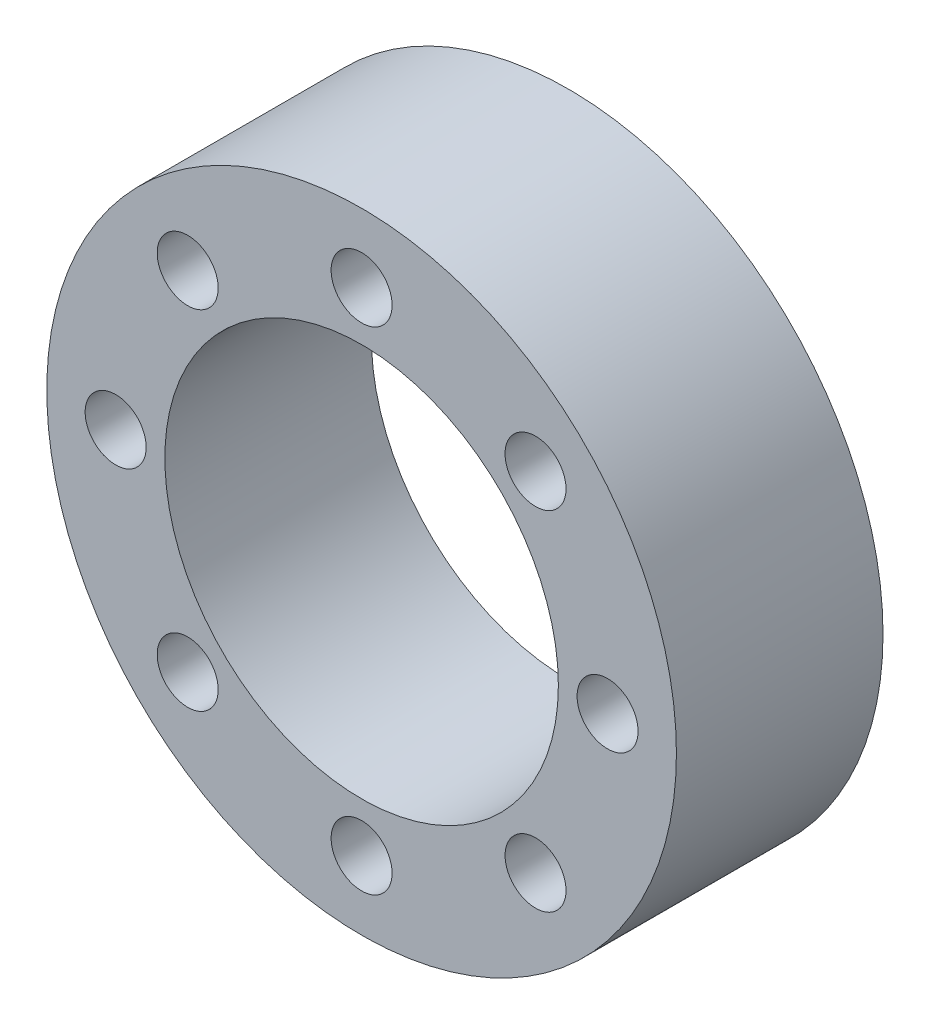
ISO-10303-21;
HEADER;
FILE_DESCRIPTION(('STEP AP214'),'2;1');
FILE_NAME('part.step','',(''),(''),'','','');
FILE_SCHEMA(('AUTOMOTIVE_DESIGN { 1 0 10303 214 1 1 1 1 }'));
ENDSEC;
DATA;
#1=APPLICATION_CONTEXT('core data for automotive mechanical design processes');
#2=APPLICATION_PROTOCOL_DEFINITION('international standard','automotive_design',2000,#1);
#3=PRODUCT_CONTEXT('',#1,'mechanical');
#4=PRODUCT('Part','Part','',(#3));
#5=PRODUCT_RELATED_PRODUCT_CATEGORY('part','',(#4));
#6=PRODUCT_DEFINITION_FORMATION('','',#4);
#7=PRODUCT_DEFINITION_CONTEXT('part definition',#1,'design');
#8=PRODUCT_DEFINITION('design','',#6,#7);
#9=PRODUCT_DEFINITION_SHAPE('','',#8);
#10=(LENGTH_UNIT() NAMED_UNIT(*) SI_UNIT(.MILLI.,.METRE.));
#11=(NAMED_UNIT(*) PLANE_ANGLE_UNIT() SI_UNIT($,.RADIAN.));
#12=(NAMED_UNIT(*) SI_UNIT($,.STERADIAN.) SOLID_ANGLE_UNIT());
#13=UNCERTAINTY_MEASURE_WITH_UNIT(LENGTH_MEASURE(1.E-05),#10,'distance_accuracy_value','');
#14=(GEOMETRIC_REPRESENTATION_CONTEXT(3) GLOBAL_UNCERTAINTY_ASSIGNED_CONTEXT((#13)) GLOBAL_UNIT_ASSIGNED_CONTEXT((#10,
#11,#12)) REPRESENTATION_CONTEXT('',''));
#15=CARTESIAN_POINT('',(0.,0.,0.));
#16=DIRECTION('',(0.,0.,1.));
#17=DIRECTION('',(1.,0.,0.));
#18=AXIS2_PLACEMENT_3D('',#15,#16,#17);
#19=CARTESIAN_POINT('',(0.,0.,10.5));
#20=DIRECTION('',(0.,0.,1.));
#21=DIRECTION('',(1.,0.,0.));
#22=AXIS2_PLACEMENT_3D('',#19,#20,#21);
#23=PLANE('',#22);
#24=CARTESIAN_POINT('',(-8.83883476483185,8.83883476483184,10.5));
#25=DIRECTION('',(0.,0.,1.));
#26=DIRECTION('',(1.,0.,0.));
#27=AXIS2_PLACEMENT_3D('',#24,#25,#26);
#28=CIRCLE('',#27,1.55);
#29=CARTESIAN_POINT('',(-7.28883476483185,8.83883476483184,10.5));
#30=VERTEX_POINT('',#29);
#31=EDGE_CURVE('E84',#30,#30,#28,.T.);
#32=ORIENTED_EDGE('',*,*,#31,.F.);
#33=EDGE_LOOP('',(#32));
#34=FACE_BOUND('',#33,.T.);
#35=CARTESIAN_POINT('',(-8.83883476483184,-8.83883476483185,10.5));
#36=DIRECTION('',(0.,0.,1.));
#37=DIRECTION('',(1.,0.,0.));
#38=AXIS2_PLACEMENT_3D('',#35,#36,#37);
#39=CIRCLE('',#38,1.55);
#40=CARTESIAN_POINT('',(-7.28883476483184,-8.83883476483185,10.5));
#41=VERTEX_POINT('',#40);
#42=EDGE_CURVE('E72',#41,#41,#39,.T.);
#43=ORIENTED_EDGE('',*,*,#42,.F.);
#44=EDGE_LOOP('',(#43));
#45=FACE_BOUND('',#44,.T.);
#46=CARTESIAN_POINT('',(8.83883476483185,-8.83883476483184,10.5));
#47=DIRECTION('',(0.,0.,1.));
#48=DIRECTION('',(1.,0.,0.));
#49=AXIS2_PLACEMENT_3D('',#46,#47,#48);
#50=CIRCLE('',#49,1.55);
#51=CARTESIAN_POINT('',(10.3888347648318,-8.83883476483184,10.5));
#52=VERTEX_POINT('',#51);
#53=EDGE_CURVE('E60',#52,#52,#50,.T.);
#54=ORIENTED_EDGE('',*,*,#53,.F.);
#55=EDGE_LOOP('',(#54));
#56=FACE_BOUND('',#55,.T.);
#57=CARTESIAN_POINT('',(8.83883476483184,8.83883476483185,10.5));
#58=DIRECTION('',(0.,0.,1.));
#59=DIRECTION('',(1.,0.,0.));
#60=AXIS2_PLACEMENT_3D('',#57,#58,#59);
#61=CIRCLE('',#60,1.55);
#62=CARTESIAN_POINT('',(10.3888347648318,8.83883476483185,10.5));
#63=VERTEX_POINT('',#62);
#64=EDGE_CURVE('E48',#63,#63,#61,.T.);
#65=ORIENTED_EDGE('',*,*,#64,.F.);
#66=EDGE_LOOP('',(#65));
#67=FACE_BOUND('',#66,.T.);
#68=CARTESIAN_POINT('',(0.,0.,10.5));
#69=DIRECTION('',(0.,0.,1.));
#70=DIRECTION('',(1.,0.,0.));
#71=AXIS2_PLACEMENT_3D('',#68,#69,#70);
#72=CIRCLE('',#71,16.);
#73=CARTESIAN_POINT('',(16.,0.,10.5));
#74=VERTEX_POINT('',#73);
#75=EDGE_CURVE('E10',#74,#74,#72,.T.);
#76=ORIENTED_EDGE('',*,*,#75,.T.);
#77=EDGE_LOOP('',(#76));
#78=FACE_BOUND('',#77,.T.);
#79=CARTESIAN_POINT('',(0.,12.5,10.5));
#80=DIRECTION('',(0.,0.,1.));
#81=DIRECTION('',(1.,0.,0.));
#82=AXIS2_PLACEMENT_3D('',#79,#80,#81);
#83=CIRCLE('',#82,1.55);
#84=CARTESIAN_POINT('',(1.55,12.5,10.5));
#85=VERTEX_POINT('',#84);
#86=EDGE_CURVE('E43',#85,#85,#83,.T.);
#87=ORIENTED_EDGE('',*,*,#86,.F.);
#88=EDGE_LOOP('',(#87));
#89=FACE_BOUND('',#88,.T.);
#90=CARTESIAN_POINT('',(12.5,0.,10.5));
#91=DIRECTION('',(0.,0.,1.));
#92=DIRECTION('',(1.,0.,0.));
#93=AXIS2_PLACEMENT_3D('',#90,#91,#92);
#94=CIRCLE('',#93,1.55);
#95=CARTESIAN_POINT('',(14.05,0.,10.5));
#96=VERTEX_POINT('',#95);
#97=EDGE_CURVE('E54',#96,#96,#94,.T.);
#98=ORIENTED_EDGE('',*,*,#97,.F.);
#99=EDGE_LOOP('',(#98));
#100=FACE_BOUND('',#99,.T.);
#101=CARTESIAN_POINT('',(0.,-12.5,10.5));
#102=DIRECTION('',(0.,0.,1.));
#103=DIRECTION('',(1.,0.,0.));
#104=AXIS2_PLACEMENT_3D('',#101,#102,#103);
#105=CIRCLE('',#104,1.55);
#106=CARTESIAN_POINT('',(1.55,-12.5,10.5));
#107=VERTEX_POINT('',#106);
#108=EDGE_CURVE('E66',#107,#107,#105,.T.);
#109=ORIENTED_EDGE('',*,*,#108,.F.);
#110=EDGE_LOOP('',(#109));
#111=FACE_BOUND('',#110,.T.);
#112=CARTESIAN_POINT('',(-12.5,0.,10.5));
#113=DIRECTION('',(0.,0.,1.));
#114=DIRECTION('',(1.,0.,0.));
#115=AXIS2_PLACEMENT_3D('',#112,#113,#114);
#116=CIRCLE('',#115,1.55);
#117=CARTESIAN_POINT('',(-10.95,0.,10.5));
#118=VERTEX_POINT('',#117);
#119=EDGE_CURVE('E78',#118,#118,#116,.T.);
#120=ORIENTED_EDGE('',*,*,#119,.F.);
#121=EDGE_LOOP('',(#120));
#122=FACE_BOUND('',#121,.T.);
#123=CARTESIAN_POINT('',(0.,0.,10.5));
#124=DIRECTION('',(0.,0.,1.));
#125=DIRECTION('',(1.,0.,0.));
#126=AXIS2_PLACEMENT_3D('',#123,#124,#125);
#127=CIRCLE('',#126,10.);
#128=CARTESIAN_POINT('',(10.,0.,10.5));
#129=VERTEX_POINT('',#128);
#130=EDGE_CURVE('E90',#129,#129,#127,.T.);
#131=ORIENTED_EDGE('',*,*,#130,.F.);
#132=EDGE_LOOP('',(#131));
#133=FACE_BOUND('',#132,.T.);
#134=ADVANCED_FACE('F32',(#34,#45,#56,#67,#78,#89,#100,#111,#122,#133),#23,.T.);
#135=CARTESIAN_POINT('',(0.,0.,0.));
#136=DIRECTION('',(0.,0.,1.));
#137=DIRECTION('',(1.,0.,0.));
#138=AXIS2_PLACEMENT_3D('',#135,#136,#137);
#139=PLANE('',#138);
#140=CARTESIAN_POINT('',(0.,0.,0.));
#141=DIRECTION('',(0.,0.,1.));
#142=DIRECTION('',(1.,0.,0.));
#143=AXIS2_PLACEMENT_3D('',#140,#141,#142);
#144=CIRCLE('',#143,16.);
#145=CARTESIAN_POINT('',(16.,0.,0.));
#146=VERTEX_POINT('',#145);
#147=EDGE_CURVE('E36',#146,#146,#144,.T.);
#148=ORIENTED_EDGE('',*,*,#147,.F.);
#149=EDGE_LOOP('',(#148));
#150=FACE_BOUND('',#149,.T.);
#151=CARTESIAN_POINT('',(0.,12.5,0.));
#152=DIRECTION('',(0.,0.,1.));
#153=DIRECTION('',(1.,0.,0.));
#154=AXIS2_PLACEMENT_3D('',#151,#152,#153);
#155=CIRCLE('',#154,1.55);
#156=CARTESIAN_POINT('',(1.55,12.5,0.));
#157=VERTEX_POINT('',#156);
#158=EDGE_CURVE('E45',#157,#157,#155,.T.);
#159=ORIENTED_EDGE('',*,*,#158,.T.);
#160=EDGE_LOOP('',(#159));
#161=FACE_BOUND('',#160,.T.);
#162=CARTESIAN_POINT('',(8.83883476483184,8.83883476483185,0.));
#163=DIRECTION('',(0.,0.,1.));
#164=DIRECTION('',(1.,0.,0.));
#165=AXIS2_PLACEMENT_3D('',#162,#163,#164);
#166=CIRCLE('',#165,1.55);
#167=CARTESIAN_POINT('',(10.3888347648318,8.83883476483185,0.));
#168=VERTEX_POINT('',#167);
#169=EDGE_CURVE('E51',#168,#168,#166,.T.);
#170=ORIENTED_EDGE('',*,*,#169,.T.);
#171=EDGE_LOOP('',(#170));
#172=FACE_BOUND('',#171,.T.);
#173=CARTESIAN_POINT('',(12.5,0.,0.));
#174=DIRECTION('',(0.,0.,1.));
#175=DIRECTION('',(1.,0.,0.));
#176=AXIS2_PLACEMENT_3D('',#173,#174,#175);
#177=CIRCLE('',#176,1.55);
#178=CARTESIAN_POINT('',(14.05,0.,0.));
#179=VERTEX_POINT('',#178);
#180=EDGE_CURVE('E57',#179,#179,#177,.T.);
#181=ORIENTED_EDGE('',*,*,#180,.T.);
#182=EDGE_LOOP('',(#181));
#183=FACE_BOUND('',#182,.T.);
#184=CARTESIAN_POINT('',(8.83883476483185,-8.83883476483184,0.));
#185=DIRECTION('',(0.,0.,1.));
#186=DIRECTION('',(1.,0.,0.));
#187=AXIS2_PLACEMENT_3D('',#184,#185,#186);
#188=CIRCLE('',#187,1.55);
#189=CARTESIAN_POINT('',(10.3888347648318,-8.83883476483184,0.));
#190=VERTEX_POINT('',#189);
#191=EDGE_CURVE('E63',#190,#190,#188,.T.);
#192=ORIENTED_EDGE('',*,*,#191,.T.);
#193=EDGE_LOOP('',(#192));
#194=FACE_BOUND('',#193,.T.);
#195=CARTESIAN_POINT('',(0.,-12.5,0.));
#196=DIRECTION('',(0.,0.,1.));
#197=DIRECTION('',(1.,0.,0.));
#198=AXIS2_PLACEMENT_3D('',#195,#196,#197);
#199=CIRCLE('',#198,1.55);
#200=CARTESIAN_POINT('',(1.55,-12.5,0.));
#201=VERTEX_POINT('',#200);
#202=EDGE_CURVE('E69',#201,#201,#199,.T.);
#203=ORIENTED_EDGE('',*,*,#202,.T.);
#204=EDGE_LOOP('',(#203));
#205=FACE_BOUND('',#204,.T.);
#206=CARTESIAN_POINT('',(-8.83883476483184,-8.83883476483185,0.));
#207=DIRECTION('',(0.,0.,1.));
#208=DIRECTION('',(1.,0.,0.));
#209=AXIS2_PLACEMENT_3D('',#206,#207,#208);
#210=CIRCLE('',#209,1.55);
#211=CARTESIAN_POINT('',(-7.28883476483184,-8.83883476483185,0.));
#212=VERTEX_POINT('',#211);
#213=EDGE_CURVE('E75',#212,#212,#210,.T.);
#214=ORIENTED_EDGE('',*,*,#213,.T.);
#215=EDGE_LOOP('',(#214));
#216=FACE_BOUND('',#215,.T.);
#217=CARTESIAN_POINT('',(-12.5,0.,0.));
#218=DIRECTION('',(0.,0.,1.));
#219=DIRECTION('',(1.,0.,0.));
#220=AXIS2_PLACEMENT_3D('',#217,#218,#219);
#221=CIRCLE('',#220,1.55);
#222=CARTESIAN_POINT('',(-10.95,0.,0.));
#223=VERTEX_POINT('',#222);
#224=EDGE_CURVE('E81',#223,#223,#221,.T.);
#225=ORIENTED_EDGE('',*,*,#224,.T.);
#226=EDGE_LOOP('',(#225));
#227=FACE_BOUND('',#226,.T.);
#228=CARTESIAN_POINT('',(-8.83883476483185,8.83883476483184,0.));
#229=DIRECTION('',(0.,0.,1.));
#230=DIRECTION('',(1.,0.,0.));
#231=AXIS2_PLACEMENT_3D('',#228,#229,#230);
#232=CIRCLE('',#231,1.55);
#233=CARTESIAN_POINT('',(-7.28883476483185,8.83883476483184,0.));
#234=VERTEX_POINT('',#233);
#235=EDGE_CURVE('E87',#234,#234,#232,.T.);
#236=ORIENTED_EDGE('',*,*,#235,.T.);
#237=EDGE_LOOP('',(#236));
#238=FACE_BOUND('',#237,.T.);
#239=CARTESIAN_POINT('',(0.,0.,0.));
#240=DIRECTION('',(0.,0.,1.));
#241=DIRECTION('',(1.,0.,0.));
#242=AXIS2_PLACEMENT_3D('',#239,#240,#241);
#243=CIRCLE('',#242,10.);
#244=CARTESIAN_POINT('',(10.,0.,0.));
#245=VERTEX_POINT('',#244);
#246=EDGE_CURVE('E93',#245,#245,#243,.T.);
#247=ORIENTED_EDGE('',*,*,#246,.T.);
#248=EDGE_LOOP('',(#247));
#249=FACE_BOUND('',#248,.T.);
#250=ADVANCED_FACE('F103',(#150,#161,#172,#183,#194,#205,#216,#227,#238,#249),#139,.F.);
#251=CARTESIAN_POINT('',(0.,0.,10.5));
#252=DIRECTION('',(0.,0.,-1.));
#253=DIRECTION('',(-1.,0.,0.));
#254=AXIS2_PLACEMENT_3D('',#251,#252,#253);
#255=CYLINDRICAL_SURFACE('',#254,16.);
#256=ORIENTED_EDGE('',*,*,#75,.F.);
#257=EDGE_LOOP('',(#256));
#258=FACE_BOUND('',#257,.T.);
#259=ORIENTED_EDGE('',*,*,#147,.T.);
#260=EDGE_LOOP('',(#259));
#261=FACE_BOUND('',#260,.T.);
#262=ADVANCED_FACE('F34',(#258,#261),#255,.T.);
#263=CARTESIAN_POINT('',(0.,12.5,10.5));
#264=DIRECTION('',(0.,0.,-1.));
#265=DIRECTION('',(-1.,0.,0.));
#266=AXIS2_PLACEMENT_3D('',#263,#264,#265);
#267=CYLINDRICAL_SURFACE('',#266,1.55);
#268=ORIENTED_EDGE('',*,*,#86,.T.);
#269=EDGE_LOOP('',(#268));
#270=FACE_BOUND('',#269,.T.);
#271=ORIENTED_EDGE('',*,*,#158,.F.);
#272=EDGE_LOOP('',(#271));
#273=FACE_BOUND('',#272,.T.);
#274=ADVANCED_FACE('F113',(#270,#273),#267,.F.);
#275=CARTESIAN_POINT('',(8.83883476483184,8.83883476483185,10.5));
#276=DIRECTION('',(0.,0.,-1.));
#277=DIRECTION('',(-1.,0.,0.));
#278=AXIS2_PLACEMENT_3D('',#275,#276,#277);
#279=CYLINDRICAL_SURFACE('',#278,1.55);
#280=ORIENTED_EDGE('',*,*,#64,.T.);
#281=EDGE_LOOP('',(#280));
#282=FACE_BOUND('',#281,.T.);
#283=ORIENTED_EDGE('',*,*,#169,.F.);
#284=EDGE_LOOP('',(#283));
#285=FACE_BOUND('',#284,.T.);
#286=ADVANCED_FACE('F116',(#282,#285),#279,.F.);
#287=CARTESIAN_POINT('',(12.5,0.,10.5));
#288=DIRECTION('',(0.,0.,-1.));
#289=DIRECTION('',(-1.,0.,0.));
#290=AXIS2_PLACEMENT_3D('',#287,#288,#289);
#291=CYLINDRICAL_SURFACE('',#290,1.55);
#292=ORIENTED_EDGE('',*,*,#97,.T.);
#293=EDGE_LOOP('',(#292));
#294=FACE_BOUND('',#293,.T.);
#295=ORIENTED_EDGE('',*,*,#180,.F.);
#296=EDGE_LOOP('',(#295));
#297=FACE_BOUND('',#296,.T.);
#298=ADVANCED_FACE('F120',(#294,#297),#291,.F.);
#299=CARTESIAN_POINT('',(8.83883476483185,-8.83883476483184,10.5));
#300=DIRECTION('',(0.,0.,-1.));
#301=DIRECTION('',(-1.,0.,0.));
#302=AXIS2_PLACEMENT_3D('',#299,#300,#301);
#303=CYLINDRICAL_SURFACE('',#302,1.55);
#304=ORIENTED_EDGE('',*,*,#53,.T.);
#305=EDGE_LOOP('',(#304));
#306=FACE_BOUND('',#305,.T.);
#307=ORIENTED_EDGE('',*,*,#191,.F.);
#308=EDGE_LOOP('',(#307));
#309=FACE_BOUND('',#308,.T.);
#310=ADVANCED_FACE('F124',(#306,#309),#303,.F.);
#311=CARTESIAN_POINT('',(0.,-12.5,10.5));
#312=DIRECTION('',(0.,0.,-1.));
#313=DIRECTION('',(-1.,0.,0.));
#314=AXIS2_PLACEMENT_3D('',#311,#312,#313);
#315=CYLINDRICAL_SURFACE('',#314,1.55);
#316=ORIENTED_EDGE('',*,*,#108,.T.);
#317=EDGE_LOOP('',(#316));
#318=FACE_BOUND('',#317,.T.);
#319=ORIENTED_EDGE('',*,*,#202,.F.);
#320=EDGE_LOOP('',(#319));
#321=FACE_BOUND('',#320,.T.);
#322=ADVANCED_FACE('F128',(#318,#321),#315,.F.);
#323=CARTESIAN_POINT('',(-8.83883476483184,-8.83883476483185,10.5));
#324=DIRECTION('',(0.,0.,-1.));
#325=DIRECTION('',(-1.,0.,0.));
#326=AXIS2_PLACEMENT_3D('',#323,#324,#325);
#327=CYLINDRICAL_SURFACE('',#326,1.55);
#328=ORIENTED_EDGE('',*,*,#42,.T.);
#329=EDGE_LOOP('',(#328));
#330=FACE_BOUND('',#329,.T.);
#331=ORIENTED_EDGE('',*,*,#213,.F.);
#332=EDGE_LOOP('',(#331));
#333=FACE_BOUND('',#332,.T.);
#334=ADVANCED_FACE('F132',(#330,#333),#327,.F.);
#335=CARTESIAN_POINT('',(-12.5,0.,10.5));
#336=DIRECTION('',(0.,0.,-1.));
#337=DIRECTION('',(-1.,0.,0.));
#338=AXIS2_PLACEMENT_3D('',#335,#336,#337);
#339=CYLINDRICAL_SURFACE('',#338,1.55);
#340=ORIENTED_EDGE('',*,*,#119,.T.);
#341=EDGE_LOOP('',(#340));
#342=FACE_BOUND('',#341,.T.);
#343=ORIENTED_EDGE('',*,*,#224,.F.);
#344=EDGE_LOOP('',(#343));
#345=FACE_BOUND('',#344,.T.);
#346=ADVANCED_FACE('F136',(#342,#345),#339,.F.);
#347=CARTESIAN_POINT('',(-8.83883476483185,8.83883476483184,10.5));
#348=DIRECTION('',(0.,0.,-1.));
#349=DIRECTION('',(-1.,0.,0.));
#350=AXIS2_PLACEMENT_3D('',#347,#348,#349);
#351=CYLINDRICAL_SURFACE('',#350,1.55);
#352=ORIENTED_EDGE('',*,*,#31,.T.);
#353=EDGE_LOOP('',(#352));
#354=FACE_BOUND('',#353,.T.);
#355=ORIENTED_EDGE('',*,*,#235,.F.);
#356=EDGE_LOOP('',(#355));
#357=FACE_BOUND('',#356,.T.);
#358=ADVANCED_FACE('F140',(#354,#357),#351,.F.);
#359=CARTESIAN_POINT('',(0.,0.,10.5));
#360=DIRECTION('',(0.,0.,-1.));
#361=DIRECTION('',(-1.,0.,0.));
#362=AXIS2_PLACEMENT_3D('',#359,#360,#361);
#363=CYLINDRICAL_SURFACE('',#362,10.);
#364=ORIENTED_EDGE('',*,*,#130,.T.);
#365=EDGE_LOOP('',(#364));
#366=FACE_BOUND('',#365,.T.);
#367=ORIENTED_EDGE('',*,*,#246,.F.);
#368=EDGE_LOOP('',(#367));
#369=FACE_BOUND('',#368,.T.);
#370=ADVANCED_FACE('F99',(#366,#369),#363,.F.);
#371=CLOSED_SHELL('',(#134,#250,#262,#274,#286,#298,#310,#322,#334,#346,#358,#370));
#372=MANIFOLD_SOLID_BREP('B2',#371);
#373=ADVANCED_BREP_SHAPE_REPRESENTATION('',(#18,#372),#14);
#374=SHAPE_DEFINITION_REPRESENTATION(#9,#373);
ENDSEC;
END-ISO-10303-21;
